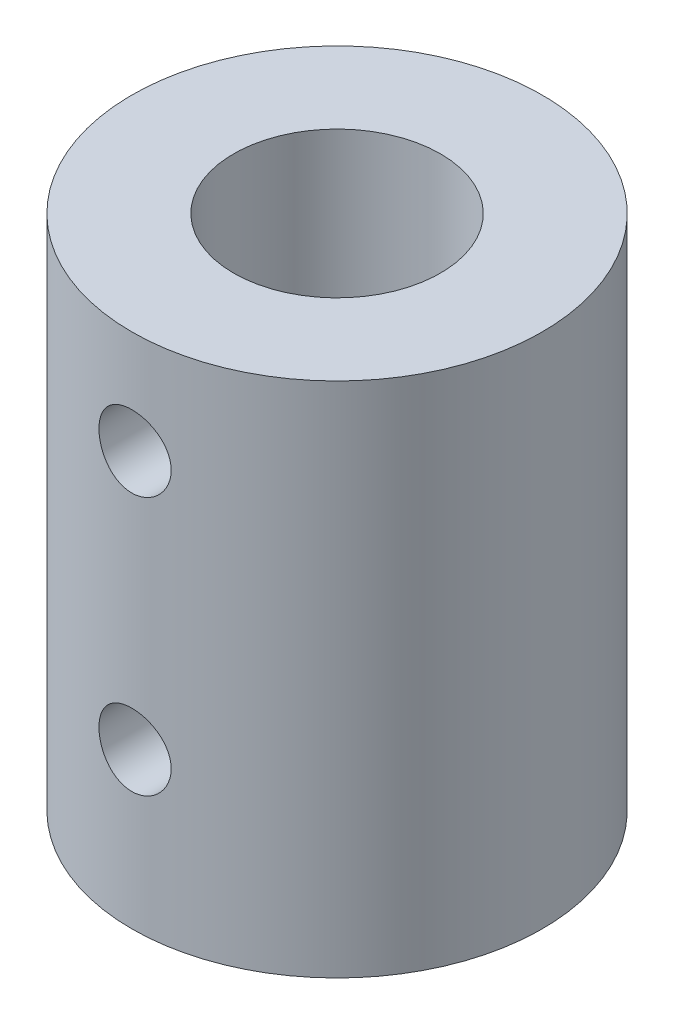
ISO-10303-21;
HEADER;
FILE_DESCRIPTION(('STEP AP214'),'2;1');
FILE_NAME('part.step','',(''),(''),'','','');
FILE_SCHEMA(('AUTOMOTIVE_DESIGN { 1 0 10303 214 1 1 1 1 }'));
ENDSEC;
DATA;
#1=APPLICATION_CONTEXT('core data for automotive mechanical design processes');
#2=APPLICATION_PROTOCOL_DEFINITION('international standard','automotive_design',2000,#1);
#3=PRODUCT_CONTEXT('',#1,'mechanical');
#4=PRODUCT('Part','Part','',(#3));
#5=PRODUCT_RELATED_PRODUCT_CATEGORY('part','',(#4));
#6=PRODUCT_DEFINITION_FORMATION('','',#4);
#7=PRODUCT_DEFINITION_CONTEXT('part definition',#1,'design');
#8=PRODUCT_DEFINITION('design','',#6,#7);
#9=PRODUCT_DEFINITION_SHAPE('','',#8);
#10=(LENGTH_UNIT() NAMED_UNIT(*) SI_UNIT(.MILLI.,.METRE.));
#11=(NAMED_UNIT(*) PLANE_ANGLE_UNIT() SI_UNIT($,.RADIAN.));
#12=(NAMED_UNIT(*) SI_UNIT($,.STERADIAN.) SOLID_ANGLE_UNIT());
#13=UNCERTAINTY_MEASURE_WITH_UNIT(LENGTH_MEASURE(1.E-05),#10,'distance_accuracy_value','');
#14=(GEOMETRIC_REPRESENTATION_CONTEXT(3) GLOBAL_UNCERTAINTY_ASSIGNED_CONTEXT((#13)) GLOBAL_UNIT_ASSIGNED_CONTEXT((#10,
#11,#12)) REPRESENTATION_CONTEXT('',''));
#15=CARTESIAN_POINT('',(0.,0.,0.));
#16=DIRECTION('',(0.,0.,1.));
#17=DIRECTION('',(1.,0.,0.));
#18=AXIS2_PLACEMENT_3D('',#15,#16,#17);
#19=CARTESIAN_POINT('',(0.,20.,0.));
#20=DIRECTION('',(0.,-1.,0.));
#21=DIRECTION('',(0.,0.,-1.));
#22=AXIS2_PLACEMENT_3D('',#19,#20,#21);
#23=CYLINDRICAL_SURFACE('',#22,7.9375);
#24=CARTESIAN_POINT('',(1.397,16.,7.81359694698927));
#25=CARTESIAN_POINT('',(1.39699693123611,15.9221847073986,7.81359840174627));
#26=CARTESIAN_POINT('',(1.39047629588871,15.8443285513628,7.81477199597349));
#27=CARTESIAN_POINT('',(1.36458007647567,15.6908054464384,7.81933461216008));
#28=CARTESIAN_POINT('',(1.3451930502074,15.6151405087855,7.82272560603437));
#29=CARTESIAN_POINT('',(1.29417267521942,15.468243664059,7.83132733801881));
#30=CARTESIAN_POINT('',(1.26255006915486,15.3970079317142,7.83653647943092));
#31=CARTESIAN_POINT('',(1.18798371098574,15.2608593654081,7.84818567923272));
#32=CARTESIAN_POINT('',(1.14504106252626,15.1959459159016,7.85462561760931));
#33=CARTESIAN_POINT('',(1.04855088460326,15.0735654414849,7.86808977974846));
#34=CARTESIAN_POINT('',(0.99490324137142,15.0161779028943,7.87511912556288));
#35=CARTESIAN_POINT('',(0.878742310585842,14.9111696067717,7.88892468775487));
#36=CARTESIAN_POINT('',(0.816228473956877,14.8635494545721,7.89570088842252));
#37=CARTESIAN_POINT('',(0.683591518892267,14.7791265857166,7.90829117349982));
#38=CARTESIAN_POINT('',(0.613420347718255,14.7423982751739,7.91409852669838));
#39=CARTESIAN_POINT('',(0.467784754274546,14.6812804079874,7.92403963817864));
#40=CARTESIAN_POINT('',(0.392320715958401,14.6568899573861,7.92817351770994));
#41=CARTESIAN_POINT('',(0.239063912397186,14.6213844666405,7.93426573766391));
#42=CARTESIAN_POINT('',(0.16130302102152,14.6101356657235,7.93624598401629));
#43=CARTESIAN_POINT('',(0.00497410366044138,14.6008164827787,7.93788318637236));
#44=CARTESIAN_POINT('',(-0.073593860991913,14.6027451066306,7.93754031763458));
#45=CARTESIAN_POINT('',(-0.228390915511303,14.6196224624546,7.93458716609966));
#46=CARTESIAN_POINT('',(-0.304636250890223,14.6344272103735,7.93200195856148));
#47=CARTESIAN_POINT('',(-0.453543339613758,14.6764094051167,7.92488262541334));
#48=CARTESIAN_POINT('',(-0.526204974122231,14.7035872619301,7.92034843522314));
#49=CARTESIAN_POINT('',(-0.666305676232365,14.7696847144562,7.90979823268266));
#50=CARTESIAN_POINT('',(-0.733716540063705,14.808662868092,7.90377485836829));
#51=CARTESIAN_POINT('',(-0.861094864732006,14.8972114633055,7.89091417263355));
#52=CARTESIAN_POINT('',(-0.921061654976201,14.9467828580728,7.88407678799231));
#53=CARTESIAN_POINT('',(-1.0327013701622,15.0559071698268,7.87023804260892));
#54=CARTESIAN_POINT('',(-1.08425118364463,15.1155859906747,7.86323571475411));
#55=CARTESIAN_POINT('',(-1.17662672381802,15.2428089753578,7.84994525192932));
#56=CARTESIAN_POINT('',(-1.21745232819186,15.310353228891,7.84365712510575));
#57=CARTESIAN_POINT('',(-1.28724945371095,15.451541366498,7.83250611731666));
#58=CARTESIAN_POINT('',(-1.31620482533382,15.5251933976319,7.82764518058506));
#59=CARTESIAN_POINT('',(-1.36129709772292,15.6764210737495,7.81992998186135));
#60=CARTESIAN_POINT('',(-1.3774352662334,15.7539963298811,7.81707552141271));
#61=CARTESIAN_POINT('',(-1.39625890982282,15.9097631144143,7.81373525734708));
#62=CARTESIAN_POINT('',(-1.39912047781356,15.9879327185991,7.81321845080701));
#63=CARTESIAN_POINT('',(-1.39178015801561,16.1436333901376,7.81452926464454));
#64=CARTESIAN_POINT('',(-1.38157883571478,16.221164484986,7.81635678353713));
#65=CARTESIAN_POINT('',(-1.34855290673796,16.3728194921062,7.82212158692007));
#66=CARTESIAN_POINT('',(-1.32581909356871,16.4469638049412,7.82604369056533));
#67=CARTESIAN_POINT('',(-1.26846921551315,16.5903906038774,7.83554285666176));
#68=CARTESIAN_POINT('',(-1.23385236712659,16.6596727690331,7.84112002823549));
#69=CARTESIAN_POINT('',(-1.15330794973129,16.7921888796353,7.8533723390591));
#70=CARTESIAN_POINT('',(-1.10726823129483,16.8553536564912,7.86005813274441));
#71=CARTESIAN_POINT('',(-1.00533772320277,16.9731244213545,7.87374373085035));
#72=CARTESIAN_POINT('',(-0.949446157457528,17.0277297344405,7.88074355997704));
#73=CARTESIAN_POINT('',(-0.828615580073649,17.1274809894382,7.89436727284298));
#74=CARTESIAN_POINT('',(-0.763578565349572,17.1725090605931,7.90098581382697));
#75=CARTESIAN_POINT('',(-0.626760639821438,17.2509993249128,7.91301374026729));
#76=CARTESIAN_POINT('',(-0.55497996607048,17.2844619244337,7.91842316820378));
#77=CARTESIAN_POINT('',(-0.407051806563859,17.3386909525711,7.92740025756277));
#78=CARTESIAN_POINT('',(-0.330926876503798,17.359517407811,7.93097661400124));
#79=CARTESIAN_POINT('',(-0.176191401481237,17.388075548281,7.93592150924212));
#80=CARTESIAN_POINT('',(-0.0975810863477163,17.3958084407145,7.93729025158211));
#81=CARTESIAN_POINT('',(0.0587592430224204,17.3979220353208,7.93766231371533));
#82=CARTESIAN_POINT('',(0.136486822525676,17.3924814987542,7.93669730238038));
#83=CARTESIAN_POINT('',(0.289902417497014,17.3687914352376,7.93257543508989));
#84=CARTESIAN_POINT('',(0.365590447729262,17.3505420010362,7.92941859500528));
#85=CARTESIAN_POINT('',(0.51269873839707,17.3018237570703,7.92126697699018));
#86=CARTESIAN_POINT('',(0.584124736260745,17.2713718207549,7.91627473780718));
#87=CARTESIAN_POINT('',(0.72088076935283,17.1991335183271,7.90499530075199));
#88=CARTESIAN_POINT('',(0.786210462419898,17.1573465165361,7.89870803025827));
#89=CARTESIAN_POINT('',(0.909815817934577,17.0629984613186,7.88543339776667));
#90=CARTESIAN_POINT('',(0.967991288312223,17.0103072405177,7.87843815441089));
#91=CARTESIAN_POINT('',(1.07473716070615,16.8959184763665,7.86458841252767));
#92=CARTESIAN_POINT('',(1.1233053079191,16.8342188246622,7.85773394737785));
#93=CARTESIAN_POINT('',(1.20981858084108,16.7029764565388,7.84488233574392));
#94=CARTESIAN_POINT('',(1.24767564150659,16.6333749609122,7.83889248416315));
#95=CARTESIAN_POINT('',(1.31110093283522,16.4887206058699,7.82853511173888));
#96=CARTESIAN_POINT('',(1.33668114818152,16.4136731455663,7.82416600966639));
#97=CARTESIAN_POINT('',(1.36942490067243,16.2819691579203,7.81848882726943));
#98=CARTESIAN_POINT('',(1.37974848891314,16.2260992038497,7.81666486928315));
#99=CARTESIAN_POINT('',(1.39353708294992,16.1134934004621,7.81421841170258));
#100=CARTESIAN_POINT('',(1.39700223832071,16.0567575700559,7.81359588590642));
#101=CARTESIAN_POINT('',(1.397,16.,7.81359694698927));
#102=B_SPLINE_CURVE_WITH_KNOTS('',3,(#24,#25,#26,#27,#28,#29,#30,#31,#32,#33,#34,#35,#36,#37,
#38,#39,#40,#41,#42,#43,#44,#45,#46,#47,#48,#49,#50,#51,#52,#53,#54,#55,#56,#57,#58,#59,#60,#61,
#62,#63,#64,#65,#66,#67,#68,#69,#70,#71,#72,#73,#74,#75,#76,#77,#78,#79,#80,#81,#82,#83,#84,#85,
#86,#87,#88,#89,#90,#91,#92,#93,#94,#95,#96,#97,#98,#99,#100,#101),.UNSPECIFIED.,.T.,.F.,(4,2,2,
2,2,2,2,2,2,2,2,2,2,2,2,2,2,2,2,2,2,2,2,2,2,2,2,2,2,2,2,2,2,2,2,2,2,2,4),(0.,0.23323826120357,
0.466684221834491,0.699925683812637,0.933144414369724,1.16865609815012,1.40418237332691,
1.64128239006054,1.87836522491094,2.11301331483606,2.34764370283187,2.5796836456897,
2.81173127786597,3.04494984494269,3.27818940608445,3.51458276708371,3.75097882419764,
3.98769544064809,4.22438864063926,4.45793333454373,4.69146791872353,4.92333244703183,
5.15521226611521,5.38946560474791,5.62373740518767,5.86074410164178,6.09774246995168,
6.33360600417882,6.56944779101826,6.80210722079467,7.03476496591182,7.26710209924914,
7.49945226491237,7.73475511364383,7.97011312173445,8.20735342634757,8.44436166299623,
8.61448665030409,8.78460792733642),.UNSPECIFIED.);
#103=CARTESIAN_POINT('',(1.397,16.,7.81359694698927));
#104=VERTEX_POINT('',#103);
#105=EDGE_CURVE('E88',#104,#104,#102,.T.);
#106=ORIENTED_EDGE('',*,*,#105,.T.);
#107=EDGE_LOOP('',(#106));
#108=FACE_BOUND('',#107,.T.);
#109=CARTESIAN_POINT('',(1.397,6.,7.81359694698927));
#110=CARTESIAN_POINT('',(1.39699693123611,5.92218470739864,7.81359840174627));
#111=CARTESIAN_POINT('',(1.39047629588871,5.8443285513628,7.81477199597349));
#112=CARTESIAN_POINT('',(1.36458007647567,5.69080544643841,7.81933461216008));
#113=CARTESIAN_POINT('',(1.3451930502074,5.61514050878555,7.82272560603437));
#114=CARTESIAN_POINT('',(1.29417267521942,5.46824366405905,7.83132733801881));
#115=CARTESIAN_POINT('',(1.26255006915486,5.39700793171423,7.83653647943092));
#116=CARTESIAN_POINT('',(1.18798371098574,5.26085936540808,7.84818567923272));
#117=CARTESIAN_POINT('',(1.14504106252626,5.19594591590159,7.85462561760931));
#118=CARTESIAN_POINT('',(1.04855088460326,5.07356544148487,7.86808977974846));
#119=CARTESIAN_POINT('',(0.994903241371419,5.0161779028943,7.87511912556288));
#120=CARTESIAN_POINT('',(0.878742310585842,4.91116960677172,7.88892468775487));
#121=CARTESIAN_POINT('',(0.816228473956878,4.86354945457212,7.89570088842252));
#122=CARTESIAN_POINT('',(0.683591518892268,4.77912658571657,7.90829117349982));
#123=CARTESIAN_POINT('',(0.613420347718255,4.74239827517394,7.91409852669838));
#124=CARTESIAN_POINT('',(0.467784754274546,4.68128040798739,7.92403963817864));
#125=CARTESIAN_POINT('',(0.392320715958401,4.65688995738615,7.92817351770994));
#126=CARTESIAN_POINT('',(0.239063912397186,4.62138446664048,7.93426573766391));
#127=CARTESIAN_POINT('',(0.16130302102152,4.61013566572347,7.93624598401629));
#128=CARTESIAN_POINT('',(0.00497410366044146,4.60081648277866,7.93788318637236));
#129=CARTESIAN_POINT('',(-0.0735938609919128,4.6027451066306,7.93754031763458));
#130=CARTESIAN_POINT('',(-0.228390915511303,4.61962246245455,7.93458716609966));
#131=CARTESIAN_POINT('',(-0.304636250890224,4.63442721037353,7.93200195856148));
#132=CARTESIAN_POINT('',(-0.453543339613759,4.67640940511674,7.92488262541334));
#133=CARTESIAN_POINT('',(-0.526204974122231,4.70358726193008,7.92034843522314));
#134=CARTESIAN_POINT('',(-0.666305676232365,4.7696847144562,7.90979823268266));
#135=CARTESIAN_POINT('',(-0.733716540063705,4.80866286809203,7.90377485836829));
#136=CARTESIAN_POINT('',(-0.861094864732006,4.8972114633055,7.89091417263355));
#137=CARTESIAN_POINT('',(-0.921061654976202,4.94678285807277,7.88407678799231));
#138=CARTESIAN_POINT('',(-1.0327013701622,5.05590716982678,7.87023804260892));
#139=CARTESIAN_POINT('',(-1.08425118364463,5.1155859906747,7.86323571475411));
#140=CARTESIAN_POINT('',(-1.17662672381802,5.24280897535778,7.84994525192932));
#141=CARTESIAN_POINT('',(-1.21745232819186,5.31035322889103,7.84365712510575));
#142=CARTESIAN_POINT('',(-1.28724945371096,5.45154136649797,7.83250611731666));
#143=CARTESIAN_POINT('',(-1.31620482533382,5.52519339763187,7.82764518058506));
#144=CARTESIAN_POINT('',(-1.36129709772292,5.67642107374947,7.81992998186135));
#145=CARTESIAN_POINT('',(-1.3774352662334,5.75399632988107,7.81707552141271));
#146=CARTESIAN_POINT('',(-1.39625890982282,5.90976311441434,7.81373525734708));
#147=CARTESIAN_POINT('',(-1.39912047781356,5.98793271859911,7.81321845080701));
#148=CARTESIAN_POINT('',(-1.39178015801561,6.14363339013762,7.81452926464454));
#149=CARTESIAN_POINT('',(-1.38157883571478,6.22116448498599,7.81635678353713));
#150=CARTESIAN_POINT('',(-1.34855290673796,6.37281949210625,7.82212158692007));
#151=CARTESIAN_POINT('',(-1.32581909356871,6.44696380494125,7.82604369056533));
#152=CARTESIAN_POINT('',(-1.26846921551315,6.59039060387741,7.83554285666176));
#153=CARTESIAN_POINT('',(-1.23385236712659,6.65967276903313,7.84112002823549));
#154=CARTESIAN_POINT('',(-1.15330794973129,6.79218887963534,7.8533723390591));
#155=CARTESIAN_POINT('',(-1.10726823129484,6.8553536564912,7.86005813274441));
#156=CARTESIAN_POINT('',(-1.00533772320277,6.97312442135451,7.87374373085034));
#157=CARTESIAN_POINT('',(-0.949446157457529,7.02772973444047,7.88074355997704));
#158=CARTESIAN_POINT('',(-0.82861558007365,7.12748098943823,7.89436727284298));
#159=CARTESIAN_POINT('',(-0.763578565349572,7.17250906059312,7.90098581382697));
#160=CARTESIAN_POINT('',(-0.626760639821438,7.25099932491277,7.91301374026729));
#161=CARTESIAN_POINT('',(-0.55497996607048,7.28446192443367,7.91842316820378));
#162=CARTESIAN_POINT('',(-0.407051806563859,7.3386909525711,7.92740025756277));
#163=CARTESIAN_POINT('',(-0.330926876503798,7.35951740781104,7.93097661400124));
#164=CARTESIAN_POINT('',(-0.176191401481237,7.38807554828098,7.93592150924212));
#165=CARTESIAN_POINT('',(-0.097581086347716,7.39580844071445,7.93729025158211));
#166=CARTESIAN_POINT('',(0.0587592430224213,7.3979220353208,7.93766231371533));
#167=CARTESIAN_POINT('',(0.136486822525677,7.3924814987542,7.93669730238038));
#168=CARTESIAN_POINT('',(0.289902417497016,7.36879143523759,7.93257543508989));
#169=CARTESIAN_POINT('',(0.365590447729263,7.35054200103622,7.92941859500528));
#170=CARTESIAN_POINT('',(0.512698738397071,7.3018237570703,7.92126697699018));
#171=CARTESIAN_POINT('',(0.584124736260745,7.27137182075492,7.91627473780718));
#172=CARTESIAN_POINT('',(0.72088076935283,7.19913351832707,7.90499530075199));
#173=CARTESIAN_POINT('',(0.786210462419898,7.15734651653608,7.89870803025827));
#174=CARTESIAN_POINT('',(0.909815817934577,7.06299846131858,7.88543339776667));
#175=CARTESIAN_POINT('',(0.967991288312224,7.01030724051775,7.87843815441089));
#176=CARTESIAN_POINT('',(1.07473716070615,6.89591847636647,7.86458841252767));
#177=CARTESIAN_POINT('',(1.1233053079191,6.83421882466219,7.85773394737785));
#178=CARTESIAN_POINT('',(1.20981858084108,6.70297645653877,7.84488233574392));
#179=CARTESIAN_POINT('',(1.2476756415066,6.63337496091222,7.83889248416315));
#180=CARTESIAN_POINT('',(1.31110093283522,6.48872060586988,7.82853511173888));
#181=CARTESIAN_POINT('',(1.33668114818152,6.41367314556628,7.82416600966639));
#182=CARTESIAN_POINT('',(1.36942490067243,6.28196915792026,7.81848882726943));
#183=CARTESIAN_POINT('',(1.37974848891314,6.22609920384975,7.81666486928315));
#184=CARTESIAN_POINT('',(1.39353708294992,6.1134934004621,7.81421841170258));
#185=CARTESIAN_POINT('',(1.39700223832071,6.05675757005594,7.81359588590642));
#186=CARTESIAN_POINT('',(1.397,6.,7.81359694698927));
#187=B_SPLINE_CURVE_WITH_KNOTS('',3,(#109,#110,#111,#112,#113,#114,#115,#116,#117,#118,#119,
#120,#121,#122,#123,#124,#125,#126,#127,#128,#129,#130,#131,#132,#133,#134,#135,#136,#137,#138,
#139,#140,#141,#142,#143,#144,#145,#146,#147,#148,#149,#150,#151,#152,#153,#154,#155,#156,#157,
#158,#159,#160,#161,#162,#163,#164,#165,#166,#167,#168,#169,#170,#171,#172,#173,#174,#175,#176,
#177,#178,#179,#180,#181,#182,#183,#184,#185,#186),.UNSPECIFIED.,.T.,.F.,(4,2,2,2,2,2,2,2,2,2,2,
2,2,2,2,2,2,2,2,2,2,2,2,2,2,2,2,2,2,2,2,2,2,2,2,2,2,2,4),(0.,0.233238261203573,
0.466684221834491,0.699925683812633,0.933144414369725,1.16865609815012,1.40418237332691,
1.64128239006054,1.87836522491094,2.11301331483606,2.34764370283187,2.5796836456897,
2.81173127786597,3.04494984494269,3.27818940608445,3.51458276708371,3.75097882419764,
3.9876954406481,4.22438864063926,4.45793333454374,4.69146791872353,4.92333244703183,
5.15521226611521,5.3894656047479,5.62373740518767,5.86074410164178,6.09774246995168,
6.33360600417882,6.56944779101825,6.80210722079467,7.03476496591182,7.26710209924914,
7.49945226491237,7.73475511364383,7.97011312173444,8.20735342634758,8.44436166299623,
8.61448665030409,8.78460792733642),.UNSPECIFIED.);
#188=CARTESIAN_POINT('',(1.397,6.,7.81359694698927));
#189=VERTEX_POINT('',#188);
#190=EDGE_CURVE('E70',#189,#189,#187,.T.);
#191=ORIENTED_EDGE('',*,*,#190,.T.);
#192=EDGE_LOOP('',(#191));
#193=FACE_BOUND('',#192,.T.);
#194=CARTESIAN_POINT('',(0.,20.,0.));
#195=DIRECTION('',(0.,1.,0.));
#196=DIRECTION('',(0.,0.,1.));
#197=AXIS2_PLACEMENT_3D('',#194,#195,#196);
#198=CIRCLE('',#197,7.9375);
#199=CARTESIAN_POINT('',(0.,20.,7.9375));
#200=VERTEX_POINT('',#199);
#201=EDGE_CURVE('E10',#200,#200,#198,.T.);
#202=ORIENTED_EDGE('',*,*,#201,.F.);
#203=EDGE_LOOP('',(#202));
#204=FACE_BOUND('',#203,.T.);
#205=CARTESIAN_POINT('',(0.,0.,0.));
#206=DIRECTION('',(0.,1.,0.));
#207=DIRECTION('',(0.,0.,1.));
#208=AXIS2_PLACEMENT_3D('',#205,#206,#207);
#209=CIRCLE('',#208,7.9375);
#210=CARTESIAN_POINT('',(0.,0.,7.9375));
#211=VERTEX_POINT('',#210);
#212=EDGE_CURVE('E51',#211,#211,#209,.T.);
#213=ORIENTED_EDGE('',*,*,#212,.T.);
#214=EDGE_LOOP('',(#213));
#215=FACE_BOUND('',#214,.T.);
#216=ADVANCED_FACE('F37',(#108,#193,#204,#215),#23,.T.);
#217=CARTESIAN_POINT('',(0.,20.,0.));
#218=DIRECTION('',(0.,1.,0.));
#219=DIRECTION('',(0.,0.,1.));
#220=AXIS2_PLACEMENT_3D('',#217,#218,#219);
#221=PLANE('',#220);
#222=CARTESIAN_POINT('',(0.,20.,0.));
#223=DIRECTION('',(0.,1.,0.));
#224=DIRECTION('',(0.,0.,1.));
#225=AXIS2_PLACEMENT_3D('',#222,#223,#224);
#226=CIRCLE('',#225,4.);
#227=CARTESIAN_POINT('',(0.,20.,4.));
#228=VERTEX_POINT('',#227);
#229=EDGE_CURVE('E60',#228,#228,#226,.T.);
#230=ORIENTED_EDGE('',*,*,#229,.F.);
#231=EDGE_LOOP('',(#230));
#232=FACE_BOUND('',#231,.T.);
#233=ORIENTED_EDGE('',*,*,#201,.T.);
#234=EDGE_LOOP('',(#233));
#235=FACE_BOUND('',#234,.T.);
#236=ADVANCED_FACE('F112',(#232,#235),#221,.T.);
#237=CARTESIAN_POINT('',(0.,0.,0.));
#238=DIRECTION('',(0.,1.,0.));
#239=DIRECTION('',(0.,0.,1.));
#240=AXIS2_PLACEMENT_3D('',#237,#238,#239);
#241=PLANE('',#240);
#242=CARTESIAN_POINT('',(0.,0.,0.));
#243=DIRECTION('',(0.,-1.,0.));
#244=DIRECTION('',(0.,0.,-1.));
#245=AXIS2_PLACEMENT_3D('',#242,#243,#244);
#246=CIRCLE('',#245,3.);
#247=CARTESIAN_POINT('',(0.,0.,-3.));
#248=VERTEX_POINT('',#247);
#249=EDGE_CURVE('E95',#248,#248,#246,.T.);
#250=ORIENTED_EDGE('',*,*,#249,.F.);
#251=EDGE_LOOP('',(#250));
#252=FACE_BOUND('',#251,.T.);
#253=ORIENTED_EDGE('',*,*,#212,.F.);
#254=EDGE_LOOP('',(#253));
#255=FACE_BOUND('',#254,.T.);
#256=ADVANCED_FACE('F114',(#252,#255),#241,.F.);
#257=CARTESIAN_POINT('',(0.,12.,0.));
#258=DIRECTION('',(0.,1.,0.));
#259=DIRECTION('',(0.,0.,1.));
#260=AXIS2_PLACEMENT_3D('',#257,#258,#259);
#261=CYLINDRICAL_SURFACE('',#260,4.);
#262=CARTESIAN_POINT('',(0.,14.603,4.));
#263=CARTESIAN_POINT('',(0.0760146471778485,14.6029988600551,4.00000079750984));
#264=CARTESIAN_POINT('',(0.152021158946851,14.6092241760882,3.99781358740163));
#265=CARTESIAN_POINT('',(0.301782989193274,14.633875790327,3.9893049039942));
#266=CARTESIAN_POINT('',(0.375538287535103,14.6523021976297,3.98298339372779));
#267=CARTESIAN_POINT('',(0.518617032881729,14.7006386282532,3.96688995480627));
#268=CARTESIAN_POINT('',(0.587948065959791,14.7305283432517,3.95712413052142));
#269=CARTESIAN_POINT('',(0.720611311187799,14.8008468659009,3.93512981621868));
#270=CARTESIAN_POINT('',(0.783942163165163,14.8412780554273,3.92290076977109));
#271=CARTESIAN_POINT('',(0.905187211896767,14.9331244114893,3.89674413564324));
#272=CARTESIAN_POINT('',(0.962845225307339,14.9848652826648,3.88277304101803));
#273=CARTESIAN_POINT('',(1.06886553552585,15.0971703314976,3.85493665807078));
#274=CARTESIAN_POINT('',(1.11722550780977,15.1577367089089,3.84107139703712));
#275=CARTESIAN_POINT('',(1.20479983785361,15.2883520021217,3.8145279092603));
#276=CARTESIAN_POINT('',(1.24367059747718,15.3586429874604,3.80190210600103));
#277=CARTESIAN_POINT('',(1.30892743177334,15.5052763354789,3.77993430108142));
#278=CARTESIAN_POINT('',(1.33531774514872,15.5816166333463,3.77059118480782));
#279=CARTESIAN_POINT('',(1.37388471859486,15.7352532606272,3.75670728588207));
#280=CARTESIAN_POINT('',(1.38654494258426,15.8124130308711,3.75200369088189));
#281=CARTESIAN_POINT('',(1.39880440975984,15.9678940276514,3.74745155483432));
#282=CARTESIAN_POINT('',(1.39840816789359,16.046214843332,3.74760133548129));
#283=CARTESIAN_POINT('',(1.38493926112229,16.1975643707348,3.75259719031405));
#284=CARTESIAN_POINT('',(1.3725116838055,16.2706597819697,3.75720426819303));
#285=CARTESIAN_POINT('',(1.3363904283936,16.4136539962262,3.77020228118149));
#286=CARTESIAN_POINT('',(1.31269527661249,16.4835523797972,3.77859371123897));
#287=CARTESIAN_POINT('',(1.25431499826889,16.619577671318,3.79837522979411));
#288=CARTESIAN_POINT('',(1.21944769397767,16.6856189339282,3.80981445534675));
#289=CARTESIAN_POINT('',(1.1398394356781,16.8111109154661,3.83438362148541));
#290=CARTESIAN_POINT('',(1.09509541265102,16.8705595772123,3.84751408706551));
#291=CARTESIAN_POINT('',(0.993959920412097,16.984784572295,3.87491142556389));
#292=CARTESIAN_POINT('',(0.937045515514261,17.039093668067,3.88920016317114));
#293=CARTESIAN_POINT('',(0.814744394988439,17.137524835378,3.91664585813882));
#294=CARTESIAN_POINT('',(0.749356701297186,17.1816457292648,3.92980268455171));
#295=CARTESIAN_POINT('',(0.610900517492419,17.2588741113337,3.95370546938521));
#296=CARTESIAN_POINT('',(0.537750372388751,17.2918452500484,3.96442109164457));
#297=CARTESIAN_POINT('',(0.386476481920148,17.3448649589625,3.98201236821968));
#298=CARTESIAN_POINT('',(0.308354653514641,17.3649184771058,3.98888949269231));
#299=CARTESIAN_POINT('',(0.153302014190627,17.3906800659066,3.99777983296332));
#300=CARTESIAN_POINT('',(0.0764880828342049,17.3970186537563,4.00000665700382));
#301=CARTESIAN_POINT('',(-0.0771281500019068,17.3969812730967,3.99999331747629));
#302=CARTESIAN_POINT('',(-0.153930450957237,17.3906076916495,3.99775399255149));
#303=CARTESIAN_POINT('',(-0.302745765405619,17.3658191192902,3.98920114454181));
#304=CARTESIAN_POINT('',(-0.374833331616706,17.3478007070705,3.98302189028087));
#305=CARTESIAN_POINT('',(-0.514925640889815,17.3007394514762,3.96734470331531));
#306=CARTESIAN_POINT('',(-0.582929854583389,17.2716951822609,3.95784634140327));
#307=CARTESIAN_POINT('',(-0.715022436694922,17.2025238929133,3.93615919277563));
#308=CARTESIAN_POINT('',(-0.778950796522875,17.1621129549873,3.92390334956049));
#309=CARTESIAN_POINT('',(-0.89931839204256,17.0716839321881,3.89807929776597));
#310=CARTESIAN_POINT('',(-0.955755139412291,17.0216626687011,3.88451065571769));
#311=CARTESIAN_POINT('',(-1.06248620841896,16.9104739437118,3.85672370609825));
#312=CARTESIAN_POINT('',(-1.11233106145643,16.8488735719071,3.8425069123016));
#313=CARTESIAN_POINT('',(-1.20104404382,16.7178847445646,3.81571061025494));
#314=CARTESIAN_POINT('',(-1.23991180294528,16.6484960264762,3.80313115723169));
#315=CARTESIAN_POINT('',(-1.30545461986559,16.5036956998388,3.78113609626381));
#316=CARTESIAN_POINT('',(-1.33213069555486,16.4282845947218,3.77172022420645));
#317=CARTESIAN_POINT('',(-1.37226438894599,16.2736293844058,3.75730675261078));
#318=CARTESIAN_POINT('',(-1.38572875018501,16.1943872563373,3.75230689917392));
#319=CARTESIAN_POINT('',(-1.39850051201849,16.0391152549899,3.74756428691475));
#320=CARTESIAN_POINT('',(-1.39856131078033,15.9631552711772,3.7475417584627));
#321=CARTESIAN_POINT('',(-1.38640667462476,15.8123690722059,3.75205511873031));
#322=CARTESIAN_POINT('',(-1.37419211436253,15.7375427766544,3.75659068267258));
#323=CARTESIAN_POINT('',(-1.33838788310065,15.592868867938,3.76949131743598));
#324=CARTESIAN_POINT('',(-1.31506535931659,15.5229464499085,3.77776622889456));
#325=CARTESIAN_POINT('',(-1.25792998027029,15.3879571430079,3.79717238362177));
#326=CARTESIAN_POINT('',(-1.22411466236315,15.3228913984435,3.80830429731891));
#327=CARTESIAN_POINT('',(-1.14510043200104,15.1961401244897,3.83282277816892));
#328=CARTESIAN_POINT('',(-1.09944072415306,15.134757733373,3.84629079201696));
#329=CARTESIAN_POINT('',(-0.998788018583742,15.0202836912507,3.87364678164227));
#330=CARTESIAN_POINT('',(-0.943792261118224,14.9671945006582,3.88753488059655));
#331=CARTESIAN_POINT('',(-0.823104424495558,14.86842954165,3.91490593600375));
#332=CARTESIAN_POINT('',(-0.757046120417157,14.8231870130168,3.92834360322603));
#333=CARTESIAN_POINT('',(-0.61780659574199,14.7444857043724,3.95263222541549));
#334=CARTESIAN_POINT('',(-0.544626361754887,14.7110252951272,3.96348353795723));
#335=CARTESIAN_POINT('',(-0.394114848115845,14.6573968525545,3.98124842540424));
#336=CARTESIAN_POINT('',(-0.316846351684818,14.6370690173667,3.98820919545714));
#337=CARTESIAN_POINT('',(-0.159714968400741,14.609873534683,3.99758377176407));
#338=CARTESIAN_POINT('',(-0.079852995328157,14.6030011975063,3.99999916222002));
#339=CARTESIAN_POINT('',(0.,14.603,4.));
#340=B_SPLINE_CURVE_WITH_KNOTS('',3,(#262,#263,#264,#265,#266,#267,#268,#269,#270,#271,#272,
#273,#274,#275,#276,#277,#278,#279,#280,#281,#282,#283,#284,#285,#286,#287,#288,#289,#290,#291,
#292,#293,#294,#295,#296,#297,#298,#299,#300,#301,#302,#303,#304,#305,#306,#307,#308,#309,#310,
#311,#312,#313,#314,#315,#316,#317,#318,#319,#320,#321,#322,#323,#324,#325,#326,#327,#328,#329,
#330,#331,#332,#333,#334,#335,#336,#337,#338,#339),.UNSPECIFIED.,.T.,.F.,(4,2,2,2,2,2,2,2,2,2,2,
2,2,2,2,2,2,2,2,2,2,2,2,2,2,2,2,2,2,2,2,2,2,2,2,2,2,2,4),(0.,0.22774982370202,0.455501683876569,
0.682851910338162,0.910253551803677,1.14535891594422,1.38052298056371,1.62323952233348,
1.86587357158521,2.09965297744493,2.3333515428466,2.55517633303508,2.77703014366979,
3.00270333160281,3.22844674251926,3.46721011338405,3.7060010690568,3.94761466803359,
4.18913566462138,4.4192939433331,4.6494090075186,4.8720730312768,5.09476585929463,
5.32360873611489,5.5525274333938,5.79291643731746,6.03331354735564,6.27369058276197,
6.51394486074758,6.74069108375805,6.9674211515832,7.18895431840883,7.41053951815225,
7.64255176925828,7.87463272318728,8.11700708360052,8.35934791526252,8.59868136236743,
8.83793137908481),.UNSPECIFIED.);
#341=CARTESIAN_POINT('',(0.,14.603,4.));
#342=VERTEX_POINT('',#341);
#343=EDGE_CURVE('E41',#342,#342,#340,.T.);
#344=ORIENTED_EDGE('',*,*,#343,.T.);
#345=EDGE_LOOP('',(#344));
#346=FACE_BOUND('',#345,.T.);
#347=CARTESIAN_POINT('',(0.,12.,0.));
#348=DIRECTION('',(0.,1.,0.));
#349=DIRECTION('',(0.,0.,1.));
#350=AXIS2_PLACEMENT_3D('',#347,#348,#349);
#351=CIRCLE('',#350,4.);
#352=CARTESIAN_POINT('',(0.,12.,4.));
#353=VERTEX_POINT('',#352);
#354=EDGE_CURVE('E57',#353,#353,#351,.T.);
#355=ORIENTED_EDGE('',*,*,#354,.F.);
#356=EDGE_LOOP('',(#355));
#357=FACE_BOUND('',#356,.T.);
#358=ORIENTED_EDGE('',*,*,#229,.T.);
#359=EDGE_LOOP('',(#358));
#360=FACE_BOUND('',#359,.T.);
#361=ADVANCED_FACE('F110',(#346,#357,#360),#261,.F.);
#362=CARTESIAN_POINT('',(0.,12.,0.));
#363=DIRECTION('',(0.,1.,0.));
#364=DIRECTION('',(0.,0.,1.));
#365=AXIS2_PLACEMENT_3D('',#362,#363,#364);
#366=PLANE('',#365);
#367=CARTESIAN_POINT('',(0.,12.,0.));
#368=DIRECTION('',(0.,-1.,0.));
#369=DIRECTION('',(0.,0.,-1.));
#370=AXIS2_PLACEMENT_3D('',#367,#368,#369);
#371=CIRCLE('',#370,3.);
#372=CARTESIAN_POINT('',(0.,12.,-3.));
#373=VERTEX_POINT('',#372);
#374=EDGE_CURVE('E96',#373,#373,#371,.T.);
#375=ORIENTED_EDGE('',*,*,#374,.T.);
#376=EDGE_LOOP('',(#375));
#377=FACE_BOUND('',#376,.T.);
#378=ORIENTED_EDGE('',*,*,#354,.T.);
#379=EDGE_LOOP('',(#378));
#380=FACE_BOUND('',#379,.T.);
#381=ADVANCED_FACE('F124',(#377,#380),#366,.T.);
#382=CARTESIAN_POINT('',(0.,12.,0.));
#383=DIRECTION('',(0.,-1.,0.));
#384=DIRECTION('',(0.,0.,-1.));
#385=AXIS2_PLACEMENT_3D('',#382,#383,#384);
#386=CYLINDRICAL_SURFACE('',#385,3.);
#387=CARTESIAN_POINT('',(1.397,6.,2.65488059995172));
#388=CARTESIAN_POINT('',(1.39699575117581,6.07354175730475,2.65488550147048));
#389=CARTESIAN_POINT('',(1.39115515536231,6.1471931693635,2.65798150457138));
#390=CARTESIAN_POINT('',(1.36806329558476,6.2922947600048,2.66993680323542));
#391=CARTESIAN_POINT('',(1.35078488015916,6.36373927637263,2.6788098116113));
#392=CARTESIAN_POINT('',(1.30568358357916,6.50206175233382,2.70107637446833));
#393=CARTESIAN_POINT('',(1.27791100381469,6.56895972767043,2.71444833126667));
#394=CARTESIAN_POINT('',(1.21276186949834,6.69713056833643,2.7441731660513));
#395=CARTESIAN_POINT('',(1.1753859542487,6.7584038077409,2.76052584558727));
#396=CARTESIAN_POINT('',(1.08897048262434,6.87840758002517,2.79579484363601));
#397=CARTESIAN_POINT('',(1.03929094901553,6.93664822326781,2.81481075691908));
#398=CARTESIAN_POINT('',(0.931015049088285,7.04434402209557,2.8524543924741));
#399=CARTESIAN_POINT('',(0.872414729062388,7.09379526103318,2.87108193843839));
#400=CARTESIAN_POINT('',(0.743900251142007,7.18523527407666,2.90711315752387));
#401=CARTESIAN_POINT('',(0.673533556744232,7.2266435234694,2.9243879540783));
#402=CARTESIAN_POINT('',(0.525879531304712,7.29681526461458,2.9545072023553));
#403=CARTESIAN_POINT('',(0.448596030468176,7.32558570308315,2.96735408716138));
#404=CARTESIAN_POINT('',(0.294473178605129,7.36779716594293,2.98645760884168));
#405=CARTESIAN_POINT('',(0.217913593912246,7.3820910235029,2.9930789814679));
#406=CARTESIAN_POINT('',(0.0632169536030778,7.39772940650324,3.00033120196987));
#407=CARTESIAN_POINT('',(-0.0149192679037955,7.39908060804076,3.00096513829021));
#408=CARTESIAN_POINT('',(-0.164232153290154,7.38917589896844,2.9963623891108));
#409=CARTESIAN_POINT('',(-0.235488020149368,7.37886628957054,2.99156633065729));
#410=CARTESIAN_POINT('',(-0.37512201310271,7.34759504107899,2.97728241830253));
#411=CARTESIAN_POINT('',(-0.4434999251018,7.32663261101855,2.96779421601327));
#412=CARTESIAN_POINT('',(-0.576692957378202,7.27445248856345,2.94483697719793));
#413=CARTESIAN_POINT('',(-0.641439610106801,7.24308630052758,2.93131059981845));
#414=CARTESIAN_POINT('',(-0.764917763474278,7.17116201754372,2.90154109917053));
#415=CARTESIAN_POINT('',(-0.823647046757963,7.13060055176674,2.88529698019881));
#416=CARTESIAN_POINT('',(-0.938725859751832,7.03746631099447,2.8500378555463));
#417=CARTESIAN_POINT('',(-0.994451770341277,6.98416686773153,2.83090469146427));
#418=CARTESIAN_POINT('',(-1.09648404931615,6.86905287180517,2.79297185502507));
#419=CARTESIAN_POINT('',(-1.1427848151879,6.80723329098252,2.77417238704886));
#420=CARTESIAN_POINT('',(-1.22685566273235,6.67305524341083,2.73806937320895));
#421=CARTESIAN_POINT('',(-1.26409219725779,6.60032730857025,2.72088538355107));
#422=CARTESIAN_POINT('',(-1.32552540149007,6.44863251779334,2.6914967793017));
#423=CARTESIAN_POINT('',(-1.3497339966952,6.36967144373733,2.67928761335764));
#424=CARTESIAN_POINT('',(-1.38262859244814,6.2139969523415,2.66245330907708));
#425=CARTESIAN_POINT('',(-1.39233762724263,6.13755510947863,2.65733045787736));
#426=CARTESIAN_POINT('',(-1.39901785489654,5.98397916559021,2.65382144798309));
#427=CARTESIAN_POINT('',(-1.39599566689989,5.90684544509307,2.65543178860304));
#428=CARTESIAN_POINT('',(-1.37823713602955,5.76132214755192,2.66468431596074));
#429=CARTESIAN_POINT('',(-1.36456202058798,5.69276318706139,2.67177963121714));
#430=CARTESIAN_POINT('',(-1.32738728906459,5.55900896283371,2.69044088988877));
#431=CARTESIAN_POINT('',(-1.30388494634184,5.4938146382853,2.70200807399168));
#432=CARTESIAN_POINT('',(-1.24655525518938,5.36526424519842,2.72894546453983));
#433=CARTESIAN_POINT('',(-1.21230319416715,5.30213020152988,2.74446596382093));
#434=CARTESIAN_POINT('',(-1.13483635519429,5.18216140282579,2.77739386186412));
#435=CARTESIAN_POINT('',(-1.09161715833542,5.12532977482124,2.79480218890092));
#436=CARTESIAN_POINT('',(-0.992056508361038,5.01327377283437,2.83177152193885));
#437=CARTESIAN_POINT('',(-0.93480872017254,4.95886174386449,2.85136472656067));
#438=CARTESIAN_POINT('',(-0.811610538534428,4.8602082314109,2.88884605118671));
#439=CARTESIAN_POINT('',(-0.745658352441654,4.8159688481119,2.90673381865096));
#440=CARTESIAN_POINT('',(-0.605496886787941,4.73846032324982,2.93915194490274));
#441=CARTESIAN_POINT('',(-0.531182589918861,4.70535792432932,2.95363037503641));
#442=CARTESIAN_POINT('',(-0.377176910262726,4.65242349335426,2.9772113061533));
#443=CARTESIAN_POINT('',(-0.297489658361272,4.63258139162655,2.98631788582215));
#444=CARTESIAN_POINT('',(-0.142162030675667,4.60821792866019,2.99755636240902));
#445=CARTESIAN_POINT('',(-0.0667368042216827,4.60255892692891,3.00020565430116));
#446=CARTESIAN_POINT('',(0.0840109472190201,4.60349447261824,2.99976947956573));
#447=CARTESIAN_POINT('',(0.159333494057771,4.61008578633774,2.99668552633597));
#448=CARTESIAN_POINT('',(0.303645195950758,4.63453740221076,2.98542652525175));
#449=CARTESIAN_POINT('',(0.372760003270397,4.65179379893711,2.97752459638671));
#450=CARTESIAN_POINT('',(0.507038894004508,4.69634083847944,2.95762105488571));
#451=CARTESIAN_POINT('',(0.572202330918738,4.72363311817562,2.9456187734936));
#452=CARTESIAN_POINT('',(0.700019617378009,4.78881836689318,2.91795180836229));
#453=CARTESIAN_POINT('',(0.762425247790949,4.82713632607393,2.90214559885099));
#454=CARTESIAN_POINT('',(0.88019421652726,4.91272268276142,2.86862569289852));
#455=CARTESIAN_POINT('',(0.935554375324979,4.95999509751439,2.85091114186053));
#456=CARTESIAN_POINT('',(1.04270727735147,5.06694724546896,2.81358381805943));
#457=CARTESIAN_POINT('',(1.09377151293112,5.12734833184849,2.79393990268966));
#458=CARTESIAN_POINT('',(1.18523949371498,5.25631481254334,2.75638520863911));
#459=CARTESIAN_POINT('',(1.22563573408384,5.32488590543046,2.7384756556457));
#460=CARTESIAN_POINT('',(1.29491791790991,5.46960740977963,2.70641274505349));
#461=CARTESIAN_POINT('',(1.32364783211142,5.54584456460494,2.69231109965634));
#462=CARTESIAN_POINT('',(1.36744757312017,5.702862036006,2.67033800256754));
#463=CARTESIAN_POINT('',(1.38256326151324,5.78362611870167,2.66244564539886));
#464=CARTESIAN_POINT('',(1.39264853764398,5.88752876226426,2.65716598255917));
#465=CARTESIAN_POINT('',(1.39427844022834,5.90997998024412,2.65631115969774));
#466=CARTESIAN_POINT('',(1.39645484669694,5.9549506996609,2.655167704807));
#467=CARTESIAN_POINT('',(1.39700130164338,5.97747020413621,2.65487909835288));
#468=CARTESIAN_POINT('',(1.397,6.,2.65488059995172));
#469=B_SPLINE_CURVE_WITH_KNOTS('',3,(#387,#388,#389,#390,#391,#392,#393,#394,#395,#396,#397,
#398,#399,#400,#401,#402,#403,#404,#405,#406,#407,#408,#409,#410,#411,#412,#413,#414,#415,#416,
#417,#418,#419,#420,#421,#422,#423,#424,#425,#426,#427,#428,#429,#430,#431,#432,#433,#434,#435,
#436,#437,#438,#439,#440,#441,#442,#443,#444,#445,#446,#447,#448,#449,#450,#451,#452,#453,#454,
#455,#456,#457,#458,#459,#460,#461,#462,#463,#464,#465,#466,#467,#468),.UNSPECIFIED.,.T.,.F.,(4,
2,2,2,2,2,2,2,2,2,2,2,2,2,2,2,2,2,2,2,2,2,2,2,2,2,2,2,2,2,2,2,2,2,2,2,2,2,2,2,4),(0.,
0.220530573221296,0.441586535302145,0.661596087268345,0.881590996804131,1.11721491649483,
1.3529435707791,1.6020095786588,1.85093850879706,2.08415789967228,2.31725698454493,
2.53271637259463,2.74819176073794,2.96688547647279,3.18565949153242,3.42297652444776,
3.66043421453988,3.90960674296628,4.15855079451324,4.38892835597033,4.61918615564092,
4.82905008321732,5.03897227785716,5.25853786466249,5.47821190911704,5.72122629626612,
5.96429080978314,6.21084746488068,6.45721667510829,6.68308168048433,6.9088870730128,
7.12294878850846,7.3370454335576,7.56086134458887,7.7847779052129,8.02816029941471,
8.27171345749214,8.51842443747318,8.76430119150603,8.83185851639461,8.89941889268274),.UNSPECIFIED.);
#470=CARTESIAN_POINT('',(1.397,6.,2.65488059995172));
#471=VERTEX_POINT('',#470);
#472=EDGE_CURVE('E62',#471,#471,#469,.T.);
#473=ORIENTED_EDGE('',*,*,#472,.T.);
#474=EDGE_LOOP('',(#473));
#475=FACE_BOUND('',#474,.T.);
#476=ORIENTED_EDGE('',*,*,#374,.F.);
#477=EDGE_LOOP('',(#476));
#478=FACE_BOUND('',#477,.T.);
#479=ORIENTED_EDGE('',*,*,#249,.T.);
#480=EDGE_LOOP('',(#479));
#481=FACE_BOUND('',#480,.T.);
#482=ADVANCED_FACE('F71',(#475,#478,#481),#386,.F.);
#483=CARTESIAN_POINT('',(0.,6.,1.9375));
#484=DIRECTION('',(0.,0.,1.));
#485=DIRECTION('',(1.,0.,0.));
#486=AXIS2_PLACEMENT_3D('',#483,#484,#485);
#487=CYLINDRICAL_SURFACE('',#486,1.397);
#488=ORIENTED_EDGE('',*,*,#472,.F.);
#489=EDGE_LOOP('',(#488));
#490=FACE_BOUND('',#489,.T.);
#491=ORIENTED_EDGE('',*,*,#190,.F.);
#492=EDGE_LOOP('',(#491));
#493=FACE_BOUND('',#492,.T.);
#494=ADVANCED_FACE('F74',(#490,#493),#487,.F.);
#495=CARTESIAN_POINT('',(0.,16.,1.9375));
#496=DIRECTION('',(0.,0.,1.));
#497=DIRECTION('',(1.,0.,0.));
#498=AXIS2_PLACEMENT_3D('',#495,#496,#497);
#499=CYLINDRICAL_SURFACE('',#498,1.397);
#500=ORIENTED_EDGE('',*,*,#343,.F.);
#501=EDGE_LOOP('',(#500));
#502=FACE_BOUND('',#501,.T.);
#503=ORIENTED_EDGE('',*,*,#105,.F.);
#504=EDGE_LOOP('',(#503));
#505=FACE_BOUND('',#504,.T.);
#506=ADVANCED_FACE('F77',(#502,#505),#499,.F.);
#507=CLOSED_SHELL('',(#216,#236,#256,#361,#381,#482,#494,#506));
#508=MANIFOLD_SOLID_BREP('B2',#507);
#509=ADVANCED_BREP_SHAPE_REPRESENTATION('',(#18,#508),#14);
#510=SHAPE_DEFINITION_REPRESENTATION(#9,#509);
ENDSEC;
END-ISO-10303-21;
